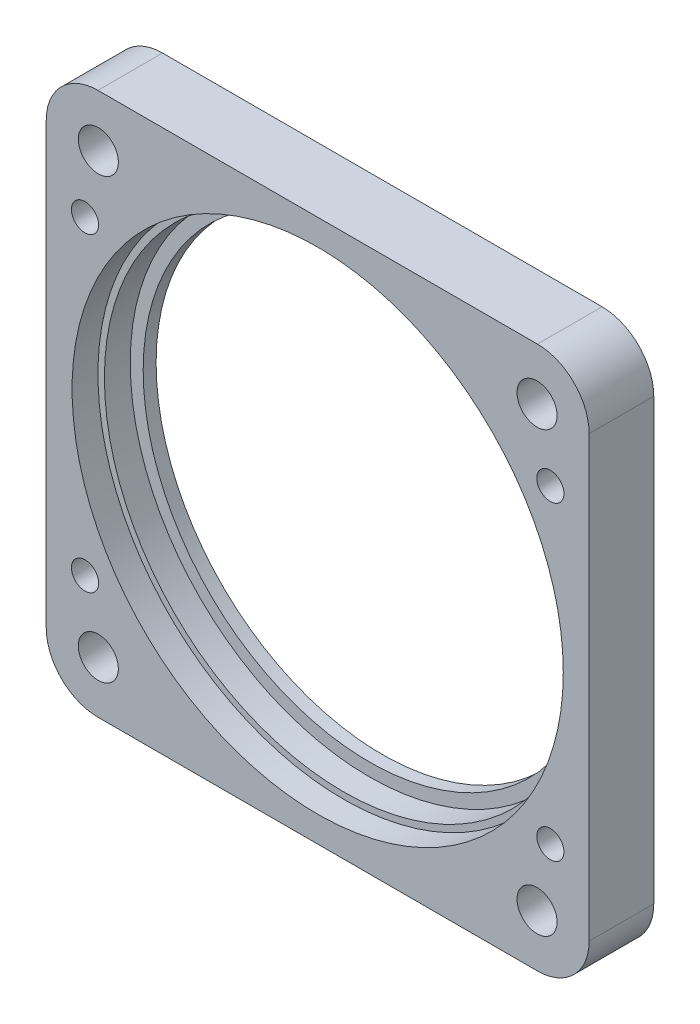
ISO-10303-21;
HEADER;
FILE_DESCRIPTION(('STEP AP214'),'2;1');
FILE_NAME('part.step','',(''),(''),'','','');
FILE_SCHEMA(('AUTOMOTIVE_DESIGN { 1 0 10303 214 1 1 1 1 }'));
ENDSEC;
DATA;
#1=APPLICATION_CONTEXT('core data for automotive mechanical design processes');
#2=APPLICATION_PROTOCOL_DEFINITION('international standard','automotive_design',2000,#1);
#3=PRODUCT_CONTEXT('',#1,'mechanical');
#4=PRODUCT('Part','Part','',(#3));
#5=PRODUCT_RELATED_PRODUCT_CATEGORY('part','',(#4));
#6=PRODUCT_DEFINITION_FORMATION('','',#4);
#7=PRODUCT_DEFINITION_CONTEXT('part definition',#1,'design');
#8=PRODUCT_DEFINITION('design','',#6,#7);
#9=PRODUCT_DEFINITION_SHAPE('','',#8);
#10=(LENGTH_UNIT() NAMED_UNIT(*) SI_UNIT(.MILLI.,.METRE.));
#11=(NAMED_UNIT(*) PLANE_ANGLE_UNIT() SI_UNIT($,.RADIAN.));
#12=(NAMED_UNIT(*) SI_UNIT($,.STERADIAN.) SOLID_ANGLE_UNIT());
#13=UNCERTAINTY_MEASURE_WITH_UNIT(LENGTH_MEASURE(1.E-05),#10,'distance_accuracy_value','');
#14=(GEOMETRIC_REPRESENTATION_CONTEXT(3) GLOBAL_UNCERTAINTY_ASSIGNED_CONTEXT((#13)) GLOBAL_UNIT_ASSIGNED_CONTEXT((#10,
#11,#12)) REPRESENTATION_CONTEXT('',''));
#15=CARTESIAN_POINT('',(0.,0.,0.));
#16=DIRECTION('',(0.,0.,1.));
#17=DIRECTION('',(1.,0.,0.));
#18=AXIS2_PLACEMENT_3D('',#15,#16,#17);
#19=CARTESIAN_POINT('',(18.,12.,5.));
#20=DIRECTION('',(0.,0.,-1.));
#21=DIRECTION('',(-1.,0.,0.));
#22=AXIS2_PLACEMENT_3D('',#19,#20,#21);
#23=CYLINDRICAL_SURFACE('',#22,1.05);
#24=CARTESIAN_POINT('',(18.,12.,5.));
#25=DIRECTION('',(0.,0.,-1.));
#26=DIRECTION('',(-1.,0.,0.));
#27=AXIS2_PLACEMENT_3D('',#24,#25,#26);
#28=CIRCLE('',#27,1.05);
#29=CARTESIAN_POINT('',(16.95,12.,5.));
#30=VERTEX_POINT('',#29);
#31=EDGE_CURVE('E197',#30,#30,#28,.T.);
#32=ORIENTED_EDGE('',*,*,#31,.F.);
#33=EDGE_LOOP('',(#32));
#34=FACE_BOUND('',#33,.T.);
#35=CARTESIAN_POINT('',(18.,12.,3.));
#36=DIRECTION('',(0.,0.,-1.));
#37=DIRECTION('',(-1.,0.,0.));
#38=AXIS2_PLACEMENT_3D('',#35,#36,#37);
#39=CIRCLE('',#38,1.05);
#40=CARTESIAN_POINT('',(16.95,12.,3.));
#41=VERTEX_POINT('',#40);
#42=EDGE_CURVE('E44',#41,#41,#39,.F.);
#43=ORIENTED_EDGE('',*,*,#42,.F.);
#44=EDGE_LOOP('',(#43));
#45=FACE_BOUND('',#44,.T.);
#46=ADVANCED_FACE('F40',(#34,#45),#23,.F.);
#47=CARTESIAN_POINT('',(-18.,-12.,5.));
#48=DIRECTION('',(0.,0.,-1.));
#49=DIRECTION('',(-1.,0.,0.));
#50=AXIS2_PLACEMENT_3D('',#47,#48,#49);
#51=CYLINDRICAL_SURFACE('',#50,1.05);
#52=CARTESIAN_POINT('',(-18.,-12.,5.));
#53=DIRECTION('',(0.,0.,-1.));
#54=DIRECTION('',(-1.,0.,0.));
#55=AXIS2_PLACEMENT_3D('',#52,#53,#54);
#56=CIRCLE('',#55,1.05);
#57=CARTESIAN_POINT('',(-19.05,-12.,5.));
#58=VERTEX_POINT('',#57);
#59=EDGE_CURVE('E188',#58,#58,#56,.T.);
#60=ORIENTED_EDGE('',*,*,#59,.F.);
#61=EDGE_LOOP('',(#60));
#62=FACE_BOUND('',#61,.T.);
#63=CARTESIAN_POINT('',(-18.,-12.,3.));
#64=DIRECTION('',(0.,0.,-1.));
#65=DIRECTION('',(-1.,0.,0.));
#66=AXIS2_PLACEMENT_3D('',#63,#64,#65);
#67=CIRCLE('',#66,1.05);
#68=CARTESIAN_POINT('',(-19.05,-12.,3.));
#69=VERTEX_POINT('',#68);
#70=EDGE_CURVE('E176',#69,#69,#67,.F.);
#71=ORIENTED_EDGE('',*,*,#70,.F.);
#72=EDGE_LOOP('',(#71));
#73=FACE_BOUND('',#72,.T.);
#74=ADVANCED_FACE('F260',(#62,#73),#51,.F.);
#75=CARTESIAN_POINT('',(0.,0.,-52.3259018078045));
#76=DIRECTION('',(0.,0.,1.));
#77=DIRECTION('',(1.,0.,0.));
#78=AXIS2_PLACEMENT_3D('',#75,#76,#77);
#79=CYLINDRICAL_SURFACE('',#78,18.5);
#80=CARTESIAN_POINT('',(0.,0.,1.));
#81=DIRECTION('',(0.,0.,1.));
#82=DIRECTION('',(1.,0.,0.));
#83=AXIS2_PLACEMENT_3D('',#80,#81,#82);
#84=CIRCLE('',#83,18.5);
#85=CARTESIAN_POINT('',(18.5,0.,1.));
#86=VERTEX_POINT('',#85);
#87=EDGE_CURVE('E147',#86,#86,#84,.F.);
#88=ORIENTED_EDGE('',*,*,#87,.T.);
#89=EDGE_LOOP('',(#88));
#90=FACE_BOUND('',#89,.T.);
#91=CARTESIAN_POINT('',(0.,0.,3.));
#92=DIRECTION('',(0.,0.,1.));
#93=DIRECTION('',(1.,0.,0.));
#94=AXIS2_PLACEMENT_3D('',#91,#92,#93);
#95=CIRCLE('',#94,18.5);
#96=CARTESIAN_POINT('',(18.5,0.,3.));
#97=VERTEX_POINT('',#96);
#98=EDGE_CURVE('E148',#97,#97,#95,.F.);
#99=ORIENTED_EDGE('',*,*,#98,.F.);
#100=EDGE_LOOP('',(#99));
#101=FACE_BOUND('',#100,.T.);
#102=ADVANCED_FACE('F266',(#90,#101),#79,.F.);
#103=CARTESIAN_POINT('',(0.,0.,0.));
#104=DIRECTION('',(0.,0.,1.));
#105=DIRECTION('',(1.,0.,0.));
#106=AXIS2_PLACEMENT_3D('',#103,#104,#105);
#107=CYLINDRICAL_SURFACE('',#106,17.5);
#108=CARTESIAN_POINT('',(0.,0.,0.));
#109=DIRECTION('',(0.,0.,1.));
#110=DIRECTION('',(1.,0.,0.));
#111=AXIS2_PLACEMENT_3D('',#108,#109,#110);
#112=CIRCLE('',#111,17.5);
#113=CARTESIAN_POINT('',(17.5,0.,0.));
#114=VERTEX_POINT('',#113);
#115=EDGE_CURVE('E146',#114,#114,#112,.T.);
#116=ORIENTED_EDGE('',*,*,#115,.F.);
#117=EDGE_LOOP('',(#116));
#118=FACE_BOUND('',#117,.T.);
#119=CARTESIAN_POINT('',(0.,0.,1.));
#120=DIRECTION('',(0.,0.,1.));
#121=DIRECTION('',(1.,0.,0.));
#122=AXIS2_PLACEMENT_3D('',#119,#120,#121);
#123=CIRCLE('',#122,17.5);
#124=CARTESIAN_POINT('',(17.5,0.,1.));
#125=VERTEX_POINT('',#124);
#126=EDGE_CURVE('E143',#125,#125,#123,.F.);
#127=ORIENTED_EDGE('',*,*,#126,.F.);
#128=EDGE_LOOP('',(#127));
#129=FACE_BOUND('',#128,.T.);
#130=ADVANCED_FACE('F305',(#118,#129),#107,.F.);
#131=CARTESIAN_POINT('',(21.,21.,5.));
#132=DIRECTION('',(-1.,0.,0.));
#133=DIRECTION('',(0.,-1.,0.));
#134=AXIS2_PLACEMENT_3D('',#131,#132,#133);
#135=PLANE('',#134);
#136=DIRECTION('',(0.,1.,0.));
#137=VECTOR('',#136,1.);
#138=CARTESIAN_POINT('',(21.,21.,5.));
#139=LINE('',#138,#137);
#140=CARTESIAN_POINT('',(21.,-17.,5.));
#141=VERTEX_POINT('',#140);
#142=CARTESIAN_POINT('',(21.,17.,5.));
#143=VERTEX_POINT('',#142);
#144=EDGE_CURVE('E134',#141,#143,#139,.T.);
#145=ORIENTED_EDGE('',*,*,#144,.F.);
#146=DIRECTION('',(0.,0.,-1.));
#147=VECTOR('',#146,1.);
#148=CARTESIAN_POINT('',(21.,-17.,5.));
#149=LINE('',#148,#147);
#150=CARTESIAN_POINT('',(21.,-17.,0.));
#151=VERTEX_POINT('',#150);
#152=EDGE_CURVE('E169',#141,#151,#149,.T.);
#153=ORIENTED_EDGE('',*,*,#152,.T.);
#154=DIRECTION('',(0.,1.,0.));
#155=VECTOR('',#154,1.);
#156=CARTESIAN_POINT('',(21.,21.,0.));
#157=LINE('',#156,#155);
#158=CARTESIAN_POINT('',(21.,17.,0.));
#159=VERTEX_POINT('',#158);
#160=EDGE_CURVE('E232',#151,#159,#157,.T.);
#161=ORIENTED_EDGE('',*,*,#160,.T.);
#162=DIRECTION('',(0.,0.,-1.));
#163=VECTOR('',#162,1.);
#164=CARTESIAN_POINT('',(21.,17.,5.));
#165=LINE('',#164,#163);
#166=EDGE_CURVE('E167',#159,#143,#165,.F.);
#167=ORIENTED_EDGE('',*,*,#166,.T.);
#168=EDGE_LOOP('',(#145,#153,#161,#167));
#169=FACE_BOUND('',#168,.T.);
#170=ADVANCED_FACE('F257',(#169),#135,.F.);
#171=CARTESIAN_POINT('',(-21.,21.,5.));
#172=DIRECTION('',(0.,-1.,0.));
#173=DIRECTION('',(0.,0.,-1.));
#174=AXIS2_PLACEMENT_3D('',#171,#172,#173);
#175=PLANE('',#174);
#176=DIRECTION('',(-1.,0.,0.));
#177=VECTOR('',#176,1.);
#178=CARTESIAN_POINT('',(-21.,21.,5.));
#179=LINE('',#178,#177);
#180=CARTESIAN_POINT('',(17.,21.,5.));
#181=VERTEX_POINT('',#180);
#182=CARTESIAN_POINT('',(-17.,21.,5.));
#183=VERTEX_POINT('',#182);
#184=EDGE_CURVE('E137',#181,#183,#179,.T.);
#185=ORIENTED_EDGE('',*,*,#184,.F.);
#186=DIRECTION('',(0.,0.,-1.));
#187=VECTOR('',#186,1.);
#188=CARTESIAN_POINT('',(17.,21.,5.));
#189=LINE('',#188,#187);
#190=CARTESIAN_POINT('',(17.,21.,0.));
#191=VERTEX_POINT('',#190);
#192=EDGE_CURVE('E13',#181,#191,#189,.T.);
#193=ORIENTED_EDGE('',*,*,#192,.T.);
#194=DIRECTION('',(-1.,0.,0.));
#195=VECTOR('',#194,1.);
#196=CARTESIAN_POINT('',(-21.,21.,0.));
#197=LINE('',#196,#195);
#198=CARTESIAN_POINT('',(-17.,21.,0.));
#199=VERTEX_POINT('',#198);
#200=EDGE_CURVE('E139',#191,#199,#197,.T.);
#201=ORIENTED_EDGE('',*,*,#200,.T.);
#202=DIRECTION('',(0.,0.,-1.));
#203=VECTOR('',#202,1.);
#204=CARTESIAN_POINT('',(-17.,21.,5.));
#205=LINE('',#204,#203);
#206=EDGE_CURVE('E49',#199,#183,#205,.F.);
#207=ORIENTED_EDGE('',*,*,#206,.T.);
#208=EDGE_LOOP('',(#185,#193,#201,#207));
#209=FACE_BOUND('',#208,.T.);
#210=ADVANCED_FACE('F241',(#209),#175,.F.);
#211=CARTESIAN_POINT('',(-21.,21.,5.));
#212=DIRECTION('',(1.,0.,0.));
#213=DIRECTION('',(0.,0.,-1.));
#214=AXIS2_PLACEMENT_3D('',#211,#212,#213);
#215=PLANE('',#214);
#216=DIRECTION('',(0.,-1.,0.));
#217=VECTOR('',#216,1.);
#218=CARTESIAN_POINT('',(-21.,21.,0.));
#219=LINE('',#218,#217);
#220=CARTESIAN_POINT('',(-21.,17.,0.));
#221=VERTEX_POINT('',#220);
#222=CARTESIAN_POINT('',(-21.,-17.,0.));
#223=VERTEX_POINT('',#222);
#224=EDGE_CURVE('E135',#221,#223,#219,.T.);
#225=ORIENTED_EDGE('',*,*,#224,.T.);
#226=DIRECTION('',(0.,0.,-1.));
#227=VECTOR('',#226,1.);
#228=CARTESIAN_POINT('',(-21.,-17.,5.));
#229=LINE('',#228,#227);
#230=CARTESIAN_POINT('',(-21.,-17.,5.));
#231=VERTEX_POINT('',#230);
#232=EDGE_CURVE('E113',#223,#231,#229,.F.);
#233=ORIENTED_EDGE('',*,*,#232,.T.);
#234=DIRECTION('',(0.,-1.,0.));
#235=VECTOR('',#234,1.);
#236=CARTESIAN_POINT('',(-21.,21.,5.));
#237=LINE('',#236,#235);
#238=CARTESIAN_POINT('',(-21.,17.,5.));
#239=VERTEX_POINT('',#238);
#240=EDGE_CURVE('E235',#239,#231,#237,.T.);
#241=ORIENTED_EDGE('',*,*,#240,.F.);
#242=DIRECTION('',(0.,0.,-1.));
#243=VECTOR('',#242,1.);
#244=CARTESIAN_POINT('',(-21.,17.,5.));
#245=LINE('',#244,#243);
#246=EDGE_CURVE('E118',#239,#221,#245,.T.);
#247=ORIENTED_EDGE('',*,*,#246,.T.);
#248=EDGE_LOOP('',(#225,#233,#241,#247));
#249=FACE_BOUND('',#248,.T.);
#250=ADVANCED_FACE('F249',(#249),#215,.F.);
#251=CARTESIAN_POINT('',(-21.,-21.,5.));
#252=DIRECTION('',(0.,1.,0.));
#253=DIRECTION('',(0.,0.,1.));
#254=AXIS2_PLACEMENT_3D('',#251,#252,#253);
#255=PLANE('',#254);
#256=DIRECTION('',(1.,0.,0.));
#257=VECTOR('',#256,1.);
#258=CARTESIAN_POINT('',(-21.,-21.,5.));
#259=LINE('',#258,#257);
#260=CARTESIAN_POINT('',(-17.,-21.,5.));
#261=VERTEX_POINT('',#260);
#262=CARTESIAN_POINT('',(17.,-21.,5.));
#263=VERTEX_POINT('',#262);
#264=EDGE_CURVE('E128',#261,#263,#259,.T.);
#265=ORIENTED_EDGE('',*,*,#264,.F.);
#266=DIRECTION('',(0.,0.,-1.));
#267=VECTOR('',#266,1.);
#268=CARTESIAN_POINT('',(-17.,-21.,5.));
#269=LINE('',#268,#267);
#270=CARTESIAN_POINT('',(-17.,-21.,0.));
#271=VERTEX_POINT('',#270);
#272=EDGE_CURVE('E112',#261,#271,#269,.T.);
#273=ORIENTED_EDGE('',*,*,#272,.T.);
#274=DIRECTION('',(1.,0.,0.));
#275=VECTOR('',#274,1.);
#276=CARTESIAN_POINT('',(-21.,-21.,0.));
#277=LINE('',#276,#275);
#278=CARTESIAN_POINT('',(17.,-21.,0.));
#279=VERTEX_POINT('',#278);
#280=EDGE_CURVE('E125',#271,#279,#277,.T.);
#281=ORIENTED_EDGE('',*,*,#280,.T.);
#282=DIRECTION('',(0.,0.,-1.));
#283=VECTOR('',#282,1.);
#284=CARTESIAN_POINT('',(17.,-21.,5.));
#285=LINE('',#284,#283);
#286=EDGE_CURVE('E130',#279,#263,#285,.F.);
#287=ORIENTED_EDGE('',*,*,#286,.T.);
#288=EDGE_LOOP('',(#265,#273,#281,#287));
#289=FACE_BOUND('',#288,.T.);
#290=ADVANCED_FACE('F124',(#289),#255,.F.);
#291=CARTESIAN_POINT('',(0.,0.,5.));
#292=DIRECTION('',(0.,0.,1.));
#293=DIRECTION('',(1.,0.,0.));
#294=AXIS2_PLACEMENT_3D('',#291,#292,#293);
#295=PLANE('',#294);
#296=CARTESIAN_POINT('',(18.,-12.,5.));
#297=DIRECTION('',(0.,0.,-1.));
#298=DIRECTION('',(1.,0.,0.));
#299=AXIS2_PLACEMENT_3D('',#296,#297,#298);
#300=CIRCLE('',#299,1.05);
#301=CARTESIAN_POINT('',(19.05,-12.,5.));
#302=VERTEX_POINT('',#301);
#303=EDGE_CURVE('E184',#302,#302,#300,.T.);
#304=ORIENTED_EDGE('',*,*,#303,.T.);
#305=EDGE_LOOP('',(#304));
#306=FACE_BOUND('',#305,.T.);
#307=ORIENTED_EDGE('',*,*,#59,.T.);
#308=EDGE_LOOP('',(#307));
#309=FACE_BOUND('',#308,.T.);
#310=CARTESIAN_POINT('',(-18.,12.,5.));
#311=DIRECTION('',(0.,0.,-1.));
#312=DIRECTION('',(1.,0.,0.));
#313=AXIS2_PLACEMENT_3D('',#310,#311,#312);
#314=CIRCLE('',#313,1.05);
#315=CARTESIAN_POINT('',(-16.95,12.,5.));
#316=VERTEX_POINT('',#315);
#317=EDGE_CURVE('E193',#316,#316,#314,.T.);
#318=ORIENTED_EDGE('',*,*,#317,.T.);
#319=EDGE_LOOP('',(#318));
#320=FACE_BOUND('',#319,.T.);
#321=ORIENTED_EDGE('',*,*,#31,.T.);
#322=EDGE_LOOP('',(#321));
#323=FACE_BOUND('',#322,.T.);
#324=CARTESIAN_POINT('',(-16.9705627484768,-16.9705627484768,5.));
#325=DIRECTION('',(0.,0.,1.));
#326=DIRECTION('',(1.,0.,0.));
#327=AXIS2_PLACEMENT_3D('',#324,#325,#326);
#328=CIRCLE('',#327,1.55);
#329=CARTESIAN_POINT('',(-15.4205627484768,-16.9705627484768,5.));
#330=VERTEX_POINT('',#329);
#331=EDGE_CURVE('E214',#330,#330,#328,.T.);
#332=ORIENTED_EDGE('',*,*,#331,.F.);
#333=EDGE_LOOP('',(#332));
#334=FACE_BOUND('',#333,.T.);
#335=CARTESIAN_POINT('',(16.9705627484774,-16.9705627484768,5.));
#336=DIRECTION('',(0.,0.,1.));
#337=DIRECTION('',(1.,0.,0.));
#338=AXIS2_PLACEMENT_3D('',#335,#336,#337);
#339=CIRCLE('',#338,1.55);
#340=CARTESIAN_POINT('',(18.5205627484774,-16.9705627484768,5.));
#341=VERTEX_POINT('',#340);
#342=EDGE_CURVE('E208',#341,#341,#339,.T.);
#343=ORIENTED_EDGE('',*,*,#342,.F.);
#344=EDGE_LOOP('',(#343));
#345=FACE_BOUND('',#344,.T.);
#346=CARTESIAN_POINT('',(16.9705627484775,16.9705627484774,5.));
#347=DIRECTION('',(0.,0.,1.));
#348=DIRECTION('',(1.,0.,0.));
#349=AXIS2_PLACEMENT_3D('',#346,#347,#348);
#350=CIRCLE('',#349,1.55);
#351=CARTESIAN_POINT('',(18.5205627484775,16.9705627484774,5.));
#352=VERTEX_POINT('',#351);
#353=EDGE_CURVE('E201',#352,#352,#350,.T.);
#354=ORIENTED_EDGE('',*,*,#353,.F.);
#355=EDGE_LOOP('',(#354));
#356=FACE_BOUND('',#355,.T.);
#357=CARTESIAN_POINT('',(-16.9705627484768,16.9705627484775,5.));
#358=DIRECTION('',(0.,0.,1.));
#359=DIRECTION('',(1.,0.,0.));
#360=AXIS2_PLACEMENT_3D('',#357,#358,#359);
#361=CIRCLE('',#360,1.55);
#362=CARTESIAN_POINT('',(-15.4205627484768,16.9705627484775,5.));
#363=VERTEX_POINT('',#362);
#364=EDGE_CURVE('E204',#363,#363,#361,.T.);
#365=ORIENTED_EDGE('',*,*,#364,.F.);
#366=EDGE_LOOP('',(#365));
#367=FACE_BOUND('',#366,.T.);
#368=CARTESIAN_POINT('',(0.,0.,5.));
#369=DIRECTION('',(0.,0.,1.));
#370=DIRECTION('',(1.,0.,0.));
#371=AXIS2_PLACEMENT_3D('',#368,#369,#370);
#372=CIRCLE('',#371,19.);
#373=CARTESIAN_POINT('',(19.,0.,5.));
#374=VERTEX_POINT('',#373);
#375=EDGE_CURVE('E222',#374,#374,#372,.T.);
#376=ORIENTED_EDGE('',*,*,#375,.F.);
#377=EDGE_LOOP('',(#376));
#378=FACE_BOUND('',#377,.T.);
#379=ORIENTED_EDGE('',*,*,#240,.T.);
#380=CARTESIAN_POINT('',(-17.,-17.,5.));
#381=DIRECTION('',(0.,0.,1.));
#382=DIRECTION('',(1.,0.,0.));
#383=AXIS2_PLACEMENT_3D('',#380,#381,#382);
#384=CIRCLE('',#383,4.);
#385=EDGE_CURVE('E165',#231,#261,#384,.T.);
#386=ORIENTED_EDGE('',*,*,#385,.T.);
#387=ORIENTED_EDGE('',*,*,#264,.T.);
#388=CARTESIAN_POINT('',(17.,-17.,5.));
#389=DIRECTION('',(0.,0.,1.));
#390=DIRECTION('',(1.,0.,0.));
#391=AXIS2_PLACEMENT_3D('',#388,#389,#390);
#392=CIRCLE('',#391,4.);
#393=EDGE_CURVE('E163',#263,#141,#392,.T.);
#394=ORIENTED_EDGE('',*,*,#393,.T.);
#395=ORIENTED_EDGE('',*,*,#144,.T.);
#396=CARTESIAN_POINT('',(17.,17.,5.));
#397=DIRECTION('',(0.,0.,1.));
#398=DIRECTION('',(1.,0.,0.));
#399=AXIS2_PLACEMENT_3D('',#396,#397,#398);
#400=CIRCLE('',#399,4.);
#401=EDGE_CURVE('E63',#143,#181,#400,.T.);
#402=ORIENTED_EDGE('',*,*,#401,.T.);
#403=ORIENTED_EDGE('',*,*,#184,.T.);
#404=CARTESIAN_POINT('',(-17.,17.,5.));
#405=DIRECTION('',(0.,0.,1.));
#406=DIRECTION('',(1.,0.,0.));
#407=AXIS2_PLACEMENT_3D('',#404,#405,#406);
#408=CIRCLE('',#407,4.);
#409=EDGE_CURVE('E160',#183,#239,#408,.T.);
#410=ORIENTED_EDGE('',*,*,#409,.T.);
#411=EDGE_LOOP('',(#379,#386,#387,#394,#395,#402,#403,#410));
#412=FACE_BOUND('',#411,.T.);
#413=ADVANCED_FACE('F247',(#306,#309,#320,#323,#334,#345,#356,#367,#378,#412),#295,.T.);
#414=CARTESIAN_POINT('',(0.,0.,0.));
#415=DIRECTION('',(0.,0.,1.));
#416=DIRECTION('',(1.,0.,0.));
#417=AXIS2_PLACEMENT_3D('',#414,#415,#416);
#418=PLANE('',#417);
#419=CARTESIAN_POINT('',(18.,-12.,0.));
#420=DIRECTION('',(0.,0.,-1.));
#421=DIRECTION('',(1.,0.,0.));
#422=AXIS2_PLACEMENT_3D('',#419,#420,#421);
#423=CIRCLE('',#422,2.);
#424=CARTESIAN_POINT('',(20.,-12.,0.));
#425=VERTEX_POINT('',#424);
#426=EDGE_CURVE('E319',#425,#425,#423,.T.);
#427=ORIENTED_EDGE('',*,*,#426,.F.);
#428=EDGE_LOOP('',(#427));
#429=FACE_BOUND('',#428,.T.);
#430=CARTESIAN_POINT('',(-18.,-12.,0.));
#431=DIRECTION('',(0.,0.,-1.));
#432=DIRECTION('',(-1.,0.,0.));
#433=AXIS2_PLACEMENT_3D('',#430,#431,#432);
#434=CIRCLE('',#433,2.);
#435=CARTESIAN_POINT('',(-20.,-12.,0.));
#436=VERTEX_POINT('',#435);
#437=EDGE_CURVE('E323',#436,#436,#434,.T.);
#438=ORIENTED_EDGE('',*,*,#437,.F.);
#439=EDGE_LOOP('',(#438));
#440=FACE_BOUND('',#439,.T.);
#441=CARTESIAN_POINT('',(-18.,12.,0.));
#442=DIRECTION('',(0.,0.,-1.));
#443=DIRECTION('',(1.,0.,0.));
#444=AXIS2_PLACEMENT_3D('',#441,#442,#443);
#445=CIRCLE('',#444,2.);
#446=CARTESIAN_POINT('',(-16.,12.,0.));
#447=VERTEX_POINT('',#446);
#448=EDGE_CURVE('E327',#447,#447,#445,.T.);
#449=ORIENTED_EDGE('',*,*,#448,.F.);
#450=EDGE_LOOP('',(#449));
#451=FACE_BOUND('',#450,.T.);
#452=CARTESIAN_POINT('',(18.,12.,0.));
#453=DIRECTION('',(0.,0.,-1.));
#454=DIRECTION('',(-1.,0.,0.));
#455=AXIS2_PLACEMENT_3D('',#452,#453,#454);
#456=CIRCLE('',#455,2.);
#457=CARTESIAN_POINT('',(16.,12.,0.));
#458=VERTEX_POINT('',#457);
#459=EDGE_CURVE('E331',#458,#458,#456,.T.);
#460=ORIENTED_EDGE('',*,*,#459,.F.);
#461=EDGE_LOOP('',(#460));
#462=FACE_BOUND('',#461,.T.);
#463=CARTESIAN_POINT('',(-16.9705627484768,-16.9705627484768,0.));
#464=DIRECTION('',(0.,0.,1.));
#465=DIRECTION('',(1.,0.,0.));
#466=AXIS2_PLACEMENT_3D('',#463,#464,#465);
#467=CIRCLE('',#466,1.55);
#468=CARTESIAN_POINT('',(-15.4205627484768,-16.9705627484768,0.));
#469=VERTEX_POINT('',#468);
#470=EDGE_CURVE('E200',#469,#469,#467,.T.);
#471=ORIENTED_EDGE('',*,*,#470,.T.);
#472=EDGE_LOOP('',(#471));
#473=FACE_BOUND('',#472,.T.);
#474=CARTESIAN_POINT('',(16.9705627484774,-16.9705627484768,0.));
#475=DIRECTION('',(0.,0.,1.));
#476=DIRECTION('',(1.,0.,0.));
#477=AXIS2_PLACEMENT_3D('',#474,#475,#476);
#478=CIRCLE('',#477,1.55);
#479=CARTESIAN_POINT('',(18.5205627484774,-16.9705627484768,0.));
#480=VERTEX_POINT('',#479);
#481=EDGE_CURVE('E211',#480,#480,#478,.T.);
#482=ORIENTED_EDGE('',*,*,#481,.T.);
#483=EDGE_LOOP('',(#482));
#484=FACE_BOUND('',#483,.T.);
#485=CARTESIAN_POINT('',(16.9705627484775,16.9705627484774,0.));
#486=DIRECTION('',(0.,0.,1.));
#487=DIRECTION('',(1.,0.,0.));
#488=AXIS2_PLACEMENT_3D('',#485,#486,#487);
#489=CIRCLE('',#488,1.55);
#490=CARTESIAN_POINT('',(18.5205627484775,16.9705627484774,0.));
#491=VERTEX_POINT('',#490);
#492=EDGE_CURVE('E205',#491,#491,#489,.T.);
#493=ORIENTED_EDGE('',*,*,#492,.T.);
#494=EDGE_LOOP('',(#493));
#495=FACE_BOUND('',#494,.T.);
#496=CARTESIAN_POINT('',(-16.9705627484768,16.9705627484775,0.));
#497=DIRECTION('',(0.,0.,1.));
#498=DIRECTION('',(1.,0.,0.));
#499=AXIS2_PLACEMENT_3D('',#496,#497,#498);
#500=CIRCLE('',#499,1.55);
#501=CARTESIAN_POINT('',(-15.4205627484768,16.9705627484775,0.));
#502=VERTEX_POINT('',#501);
#503=EDGE_CURVE('E219',#502,#502,#500,.T.);
#504=ORIENTED_EDGE('',*,*,#503,.T.);
#505=EDGE_LOOP('',(#504));
#506=FACE_BOUND('',#505,.T.);
#507=ORIENTED_EDGE('',*,*,#115,.T.);
#508=EDGE_LOOP('',(#507));
#509=FACE_BOUND('',#508,.T.);
#510=ORIENTED_EDGE('',*,*,#280,.F.);
#511=CARTESIAN_POINT('',(-17.,-17.,0.));
#512=DIRECTION('',(0.,0.,1.));
#513=DIRECTION('',(1.,0.,0.));
#514=AXIS2_PLACEMENT_3D('',#511,#512,#513);
#515=CIRCLE('',#514,4.);
#516=EDGE_CURVE('E108',#271,#223,#515,.F.);
#517=ORIENTED_EDGE('',*,*,#516,.T.);
#518=ORIENTED_EDGE('',*,*,#224,.F.);
#519=CARTESIAN_POINT('',(-17.,17.,0.));
#520=DIRECTION('',(0.,0.,1.));
#521=DIRECTION('',(1.,0.,0.));
#522=AXIS2_PLACEMENT_3D('',#519,#520,#521);
#523=CIRCLE('',#522,4.);
#524=EDGE_CURVE('E129',#221,#199,#523,.F.);
#525=ORIENTED_EDGE('',*,*,#524,.T.);
#526=ORIENTED_EDGE('',*,*,#200,.F.);
#527=CARTESIAN_POINT('',(17.,17.,0.));
#528=DIRECTION('',(0.,0.,1.));
#529=DIRECTION('',(1.,0.,0.));
#530=AXIS2_PLACEMENT_3D('',#527,#528,#529);
#531=CIRCLE('',#530,4.);
#532=EDGE_CURVE('E154',#191,#159,#531,.F.);
#533=ORIENTED_EDGE('',*,*,#532,.T.);
#534=ORIENTED_EDGE('',*,*,#160,.F.);
#535=CARTESIAN_POINT('',(17.,-17.,0.));
#536=DIRECTION('',(0.,0.,1.));
#537=DIRECTION('',(1.,0.,0.));
#538=AXIS2_PLACEMENT_3D('',#535,#536,#537);
#539=CIRCLE('',#538,4.);
#540=EDGE_CURVE('E119',#151,#279,#539,.F.);
#541=ORIENTED_EDGE('',*,*,#540,.T.);
#542=EDGE_LOOP('',(#510,#517,#518,#525,#526,#533,#534,#541));
#543=FACE_BOUND('',#542,.T.);
#544=ADVANCED_FACE('F132',(#429,#440,#451,#462,#473,#484,#495,#506,#509,#543),#418,.F.);
#545=CARTESIAN_POINT('',(0.,0.,1.));
#546=DIRECTION('',(0.,0.,1.));
#547=DIRECTION('',(1.,0.,0.));
#548=AXIS2_PLACEMENT_3D('',#545,#546,#547);
#549=PLANE('',#548);
#550=ORIENTED_EDGE('',*,*,#87,.F.);
#551=EDGE_LOOP('',(#550));
#552=FACE_BOUND('',#551,.T.);
#553=ORIENTED_EDGE('',*,*,#126,.T.);
#554=EDGE_LOOP('',(#553));
#555=FACE_BOUND('',#554,.T.);
#556=ADVANCED_FACE('F295',(#552,#555),#549,.T.);
#557=CARTESIAN_POINT('',(0.,0.,3.));
#558=DIRECTION('',(0.,0.,1.));
#559=DIRECTION('',(1.,0.,0.));
#560=AXIS2_PLACEMENT_3D('',#557,#558,#559);
#561=PLANE('',#560);
#562=CARTESIAN_POINT('',(0.,0.,3.));
#563=DIRECTION('',(0.,0.,1.));
#564=DIRECTION('',(1.,0.,0.));
#565=AXIS2_PLACEMENT_3D('',#562,#563,#564);
#566=CIRCLE('',#565,19.);
#567=CARTESIAN_POINT('',(19.,0.,3.));
#568=VERTEX_POINT('',#567);
#569=EDGE_CURVE('E151',#568,#568,#566,.F.);
#570=ORIENTED_EDGE('',*,*,#569,.F.);
#571=EDGE_LOOP('',(#570));
#572=FACE_BOUND('',#571,.T.);
#573=ORIENTED_EDGE('',*,*,#98,.T.);
#574=EDGE_LOOP('',(#573));
#575=FACE_BOUND('',#574,.T.);
#576=ADVANCED_FACE('F291',(#572,#575),#561,.T.);
#577=CARTESIAN_POINT('',(0.,0.,-52.7401153701776));
#578=DIRECTION('',(0.,0.,1.));
#579=DIRECTION('',(1.,0.,0.));
#580=AXIS2_PLACEMENT_3D('',#577,#578,#579);
#581=CYLINDRICAL_SURFACE('',#580,19.);
#582=ORIENTED_EDGE('',*,*,#569,.T.);
#583=EDGE_LOOP('',(#582));
#584=FACE_BOUND('',#583,.T.);
#585=ORIENTED_EDGE('',*,*,#375,.T.);
#586=EDGE_LOOP('',(#585));
#587=FACE_BOUND('',#586,.T.);
#588=ADVANCED_FACE('F294',(#584,#587),#581,.F.);
#589=CARTESIAN_POINT('',(-17.,-17.,5.));
#590=DIRECTION('',(0.,0.,-1.));
#591=DIRECTION('',(-1.,0.,0.));
#592=AXIS2_PLACEMENT_3D('',#589,#590,#591);
#593=CYLINDRICAL_SURFACE('',#592,4.);
#594=ORIENTED_EDGE('',*,*,#385,.F.);
#595=ORIENTED_EDGE('',*,*,#232,.F.);
#596=ORIENTED_EDGE('',*,*,#516,.F.);
#597=ORIENTED_EDGE('',*,*,#272,.F.);
#598=EDGE_LOOP('',(#594,#595,#596,#597));
#599=FACE_BOUND('',#598,.T.);
#600=ADVANCED_FACE('F111',(#599),#593,.T.);
#601=CARTESIAN_POINT('',(17.,-17.,5.));
#602=DIRECTION('',(0.,0.,-1.));
#603=DIRECTION('',(-1.,0.,0.));
#604=AXIS2_PLACEMENT_3D('',#601,#602,#603);
#605=CYLINDRICAL_SURFACE('',#604,4.);
#606=ORIENTED_EDGE('',*,*,#393,.F.);
#607=ORIENTED_EDGE('',*,*,#286,.F.);
#608=ORIENTED_EDGE('',*,*,#540,.F.);
#609=ORIENTED_EDGE('',*,*,#152,.F.);
#610=EDGE_LOOP('',(#606,#607,#608,#609));
#611=FACE_BOUND('',#610,.T.);
#612=ADVANCED_FACE('F560',(#611),#605,.T.);
#613=CARTESIAN_POINT('',(17.,17.,5.));
#614=DIRECTION('',(0.,0.,-1.));
#615=DIRECTION('',(-1.,0.,0.));
#616=AXIS2_PLACEMENT_3D('',#613,#614,#615);
#617=CYLINDRICAL_SURFACE('',#616,4.);
#618=ORIENTED_EDGE('',*,*,#401,.F.);
#619=ORIENTED_EDGE('',*,*,#166,.F.);
#620=ORIENTED_EDGE('',*,*,#532,.F.);
#621=ORIENTED_EDGE('',*,*,#192,.F.);
#622=EDGE_LOOP('',(#618,#619,#620,#621));
#623=FACE_BOUND('',#622,.T.);
#624=ADVANCED_FACE('F551',(#623),#617,.T.);
#625=CARTESIAN_POINT('',(-17.,17.,5.));
#626=DIRECTION('',(0.,0.,-1.));
#627=DIRECTION('',(-1.,0.,0.));
#628=AXIS2_PLACEMENT_3D('',#625,#626,#627);
#629=CYLINDRICAL_SURFACE('',#628,4.);
#630=ORIENTED_EDGE('',*,*,#409,.F.);
#631=ORIENTED_EDGE('',*,*,#206,.F.);
#632=ORIENTED_EDGE('',*,*,#524,.F.);
#633=ORIENTED_EDGE('',*,*,#246,.F.);
#634=EDGE_LOOP('',(#630,#631,#632,#633));
#635=FACE_BOUND('',#634,.T.);
#636=ADVANCED_FACE('F42',(#635),#629,.T.);
#637=CARTESIAN_POINT('',(-16.9705627484768,16.9705627484775,0.));
#638=DIRECTION('',(0.,0.,1.));
#639=DIRECTION('',(1.,0.,0.));
#640=AXIS2_PLACEMENT_3D('',#637,#638,#639);
#641=CYLINDRICAL_SURFACE('',#640,1.55);
#642=ORIENTED_EDGE('',*,*,#503,.F.);
#643=EDGE_LOOP('',(#642));
#644=FACE_BOUND('',#643,.T.);
#645=ORIENTED_EDGE('',*,*,#364,.T.);
#646=EDGE_LOOP('',(#645));
#647=FACE_BOUND('',#646,.T.);
#648=ADVANCED_FACE('F278',(#644,#647),#641,.F.);
#649=CARTESIAN_POINT('',(16.9705627484775,16.9705627484774,0.));
#650=DIRECTION('',(0.,0.,1.));
#651=DIRECTION('',(1.,0.,0.));
#652=AXIS2_PLACEMENT_3D('',#649,#650,#651);
#653=CYLINDRICAL_SURFACE('',#652,1.55);
#654=ORIENTED_EDGE('',*,*,#492,.F.);
#655=EDGE_LOOP('',(#654));
#656=FACE_BOUND('',#655,.T.);
#657=ORIENTED_EDGE('',*,*,#353,.T.);
#658=EDGE_LOOP('',(#657));
#659=FACE_BOUND('',#658,.T.);
#660=ADVANCED_FACE('F274',(#656,#659),#653,.F.);
#661=CARTESIAN_POINT('',(16.9705627484774,-16.9705627484768,0.));
#662=DIRECTION('',(0.,0.,1.));
#663=DIRECTION('',(1.,0.,0.));
#664=AXIS2_PLACEMENT_3D('',#661,#662,#663);
#665=CYLINDRICAL_SURFACE('',#664,1.55);
#666=ORIENTED_EDGE('',*,*,#481,.F.);
#667=EDGE_LOOP('',(#666));
#668=FACE_BOUND('',#667,.T.);
#669=ORIENTED_EDGE('',*,*,#342,.T.);
#670=EDGE_LOOP('',(#669));
#671=FACE_BOUND('',#670,.T.);
#672=ADVANCED_FACE('F277',(#668,#671),#665,.F.);
#673=CARTESIAN_POINT('',(-16.9705627484768,-16.9705627484768,0.));
#674=DIRECTION('',(0.,0.,1.));
#675=DIRECTION('',(1.,0.,0.));
#676=AXIS2_PLACEMENT_3D('',#673,#674,#675);
#677=CYLINDRICAL_SURFACE('',#676,1.55);
#678=ORIENTED_EDGE('',*,*,#470,.F.);
#679=EDGE_LOOP('',(#678));
#680=FACE_BOUND('',#679,.T.);
#681=ORIENTED_EDGE('',*,*,#331,.T.);
#682=EDGE_LOOP('',(#681));
#683=FACE_BOUND('',#682,.T.);
#684=ADVANCED_FACE('F282',(#680,#683),#677,.F.);
#685=CARTESIAN_POINT('',(-18.,12.,5.));
#686=DIRECTION('',(0.,0.,-1.));
#687=DIRECTION('',(-1.,0.,0.));
#688=AXIS2_PLACEMENT_3D('',#685,#686,#687);
#689=CYLINDRICAL_SURFACE('',#688,1.05);
#690=CARTESIAN_POINT('',(-18.,12.,3.));
#691=DIRECTION('',(0.,0.,1.));
#692=DIRECTION('',(1.,0.,0.));
#693=AXIS2_PLACEMENT_3D('',#690,#691,#692);
#694=CIRCLE('',#693,1.05);
#695=CARTESIAN_POINT('',(-16.95,12.,3.));
#696=VERTEX_POINT('',#695);
#697=EDGE_CURVE('E179',#696,#696,#694,.F.);
#698=ORIENTED_EDGE('',*,*,#697,.T.);
#699=EDGE_LOOP('',(#698));
#700=FACE_BOUND('',#699,.T.);
#701=ORIENTED_EDGE('',*,*,#317,.F.);
#702=EDGE_LOOP('',(#701));
#703=FACE_BOUND('',#702,.T.);
#704=ADVANCED_FACE('F286',(#700,#703),#689,.F.);
#705=CARTESIAN_POINT('',(18.,-12.,5.));
#706=DIRECTION('',(0.,0.,-1.));
#707=DIRECTION('',(-1.,0.,0.));
#708=AXIS2_PLACEMENT_3D('',#705,#706,#707);
#709=CYLINDRICAL_SURFACE('',#708,1.05);
#710=CARTESIAN_POINT('',(18.,-12.,3.));
#711=DIRECTION('',(0.,0.,1.));
#712=DIRECTION('',(1.,0.,0.));
#713=AXIS2_PLACEMENT_3D('',#710,#711,#712);
#714=CIRCLE('',#713,1.05);
#715=CARTESIAN_POINT('',(19.05,-12.,3.));
#716=VERTEX_POINT('',#715);
#717=EDGE_CURVE('E173',#716,#716,#714,.F.);
#718=ORIENTED_EDGE('',*,*,#717,.T.);
#719=EDGE_LOOP('',(#718));
#720=FACE_BOUND('',#719,.T.);
#721=ORIENTED_EDGE('',*,*,#303,.F.);
#722=EDGE_LOOP('',(#721));
#723=FACE_BOUND('',#722,.T.);
#724=ADVANCED_FACE('F273',(#720,#723),#709,.F.);
#725=CARTESIAN_POINT('',(18.,-12.,3.));
#726=DIRECTION('',(0.,0.,1.));
#727=DIRECTION('',(1.,0.,0.));
#728=AXIS2_PLACEMENT_3D('',#725,#726,#727);
#729=PLANE('',#728);
#730=CARTESIAN_POINT('',(18.,-12.,3.));
#731=DIRECTION('',(0.,0.,-1.));
#732=DIRECTION('',(1.,0.,0.));
#733=AXIS2_PLACEMENT_3D('',#730,#731,#732);
#734=CIRCLE('',#733,2.);
#735=CARTESIAN_POINT('',(20.,-12.,3.));
#736=VERTEX_POINT('',#735);
#737=EDGE_CURVE('E420',#736,#736,#734,.T.);
#738=ORIENTED_EDGE('',*,*,#737,.T.);
#739=EDGE_LOOP('',(#738));
#740=FACE_BOUND('',#739,.T.);
#741=ORIENTED_EDGE('',*,*,#717,.F.);
#742=EDGE_LOOP('',(#741));
#743=FACE_BOUND('',#742,.T.);
#744=ADVANCED_FACE('F376',(#740,#743),#729,.F.);
#745=CARTESIAN_POINT('',(18.,-12.,3.));
#746=DIRECTION('',(0.,0.,-1.));
#747=DIRECTION('',(-1.,0.,0.));
#748=AXIS2_PLACEMENT_3D('',#745,#746,#747);
#749=CYLINDRICAL_SURFACE('',#748,2.);
#750=ORIENTED_EDGE('',*,*,#737,.F.);
#751=EDGE_LOOP('',(#750));
#752=FACE_BOUND('',#751,.T.);
#753=ORIENTED_EDGE('',*,*,#426,.T.);
#754=EDGE_LOOP('',(#753));
#755=FACE_BOUND('',#754,.T.);
#756=ADVANCED_FACE('F390',(#752,#755),#749,.F.);
#757=CARTESIAN_POINT('',(-18.,-12.,3.));
#758=DIRECTION('',(0.,0.,-1.));
#759=DIRECTION('',(-1.,0.,0.));
#760=AXIS2_PLACEMENT_3D('',#757,#758,#759);
#761=PLANE('',#760);
#762=CARTESIAN_POINT('',(-18.,-12.,3.));
#763=DIRECTION('',(0.,0.,-1.));
#764=DIRECTION('',(-1.,0.,0.));
#765=AXIS2_PLACEMENT_3D('',#762,#763,#764);
#766=CIRCLE('',#765,2.);
#767=CARTESIAN_POINT('',(-20.,-12.,3.));
#768=VERTEX_POINT('',#767);
#769=EDGE_CURVE('E415',#768,#768,#766,.T.);
#770=ORIENTED_EDGE('',*,*,#769,.T.);
#771=EDGE_LOOP('',(#770));
#772=FACE_BOUND('',#771,.T.);
#773=ORIENTED_EDGE('',*,*,#70,.T.);
#774=EDGE_LOOP('',(#773));
#775=FACE_BOUND('',#774,.T.);
#776=ADVANCED_FACE('F394',(#772,#775),#761,.T.);
#777=CARTESIAN_POINT('',(-18.,-12.,3.));
#778=DIRECTION('',(0.,0.,-1.));
#779=DIRECTION('',(-1.,0.,0.));
#780=AXIS2_PLACEMENT_3D('',#777,#778,#779);
#781=CYLINDRICAL_SURFACE('',#780,2.);
#782=ORIENTED_EDGE('',*,*,#769,.F.);
#783=EDGE_LOOP('',(#782));
#784=FACE_BOUND('',#783,.T.);
#785=ORIENTED_EDGE('',*,*,#437,.T.);
#786=EDGE_LOOP('',(#785));
#787=FACE_BOUND('',#786,.T.);
#788=ADVANCED_FACE('F398',(#784,#787),#781,.F.);
#789=CARTESIAN_POINT('',(-18.,12.,3.));
#790=DIRECTION('',(0.,0.,1.));
#791=DIRECTION('',(1.,0.,0.));
#792=AXIS2_PLACEMENT_3D('',#789,#790,#791);
#793=PLANE('',#792);
#794=CARTESIAN_POINT('',(-18.,12.,3.));
#795=DIRECTION('',(0.,0.,-1.));
#796=DIRECTION('',(1.,0.,0.));
#797=AXIS2_PLACEMENT_3D('',#794,#795,#796);
#798=CIRCLE('',#797,2.);
#799=CARTESIAN_POINT('',(-16.,12.,3.));
#800=VERTEX_POINT('',#799);
#801=EDGE_CURVE('E363',#800,#800,#798,.T.);
#802=ORIENTED_EDGE('',*,*,#801,.T.);
#803=EDGE_LOOP('',(#802));
#804=FACE_BOUND('',#803,.T.);
#805=ORIENTED_EDGE('',*,*,#697,.F.);
#806=EDGE_LOOP('',(#805));
#807=FACE_BOUND('',#806,.T.);
#808=ADVANCED_FACE('F402',(#804,#807),#793,.F.);
#809=CARTESIAN_POINT('',(-18.,12.,3.));
#810=DIRECTION('',(0.,0.,-1.));
#811=DIRECTION('',(-1.,0.,0.));
#812=AXIS2_PLACEMENT_3D('',#809,#810,#811);
#813=CYLINDRICAL_SURFACE('',#812,2.);
#814=ORIENTED_EDGE('',*,*,#801,.F.);
#815=EDGE_LOOP('',(#814));
#816=FACE_BOUND('',#815,.T.);
#817=ORIENTED_EDGE('',*,*,#448,.T.);
#818=EDGE_LOOP('',(#817));
#819=FACE_BOUND('',#818,.T.);
#820=ADVANCED_FACE('F386',(#816,#819),#813,.F.);
#821=CARTESIAN_POINT('',(18.,12.,3.));
#822=DIRECTION('',(0.,0.,-1.));
#823=DIRECTION('',(-1.,0.,0.));
#824=AXIS2_PLACEMENT_3D('',#821,#822,#823);
#825=PLANE('',#824);
#826=CARTESIAN_POINT('',(18.,12.,3.));
#827=DIRECTION('',(0.,0.,-1.));
#828=DIRECTION('',(-1.,0.,0.));
#829=AXIS2_PLACEMENT_3D('',#826,#827,#828);
#830=CIRCLE('',#829,2.);
#831=CARTESIAN_POINT('',(16.,12.,3.));
#832=VERTEX_POINT('',#831);
#833=EDGE_CURVE('E177',#832,#832,#830,.T.);
#834=ORIENTED_EDGE('',*,*,#833,.T.);
#835=EDGE_LOOP('',(#834));
#836=FACE_BOUND('',#835,.T.);
#837=ORIENTED_EDGE('',*,*,#42,.T.);
#838=EDGE_LOOP('',(#837));
#839=FACE_BOUND('',#838,.T.);
#840=ADVANCED_FACE('F382',(#836,#839),#825,.T.);
#841=CARTESIAN_POINT('',(18.,12.,3.));
#842=DIRECTION('',(0.,0.,-1.));
#843=DIRECTION('',(-1.,0.,0.));
#844=AXIS2_PLACEMENT_3D('',#841,#842,#843);
#845=CYLINDRICAL_SURFACE('',#844,2.);
#846=ORIENTED_EDGE('',*,*,#833,.F.);
#847=EDGE_LOOP('',(#846));
#848=FACE_BOUND('',#847,.T.);
#849=ORIENTED_EDGE('',*,*,#459,.T.);
#850=EDGE_LOOP('',(#849));
#851=FACE_BOUND('',#850,.T.);
#852=ADVANCED_FACE('F379',(#848,#851),#845,.F.);
#853=CLOSED_SHELL('',(#46,#74,#102,#130,#170,#210,#250,#290,#413,#544,#556,#576,#588,#600,#612,
#624,#636,#648,#660,#672,#684,#704,#724,#744,#756,#776,#788,#808,#820,#840,#852));
#854=MANIFOLD_SOLID_BREP('B2',#853);
#855=ADVANCED_BREP_SHAPE_REPRESENTATION('',(#18,#854),#14);
#856=SHAPE_DEFINITION_REPRESENTATION(#9,#855);
ENDSEC;
END-ISO-10303-21;
